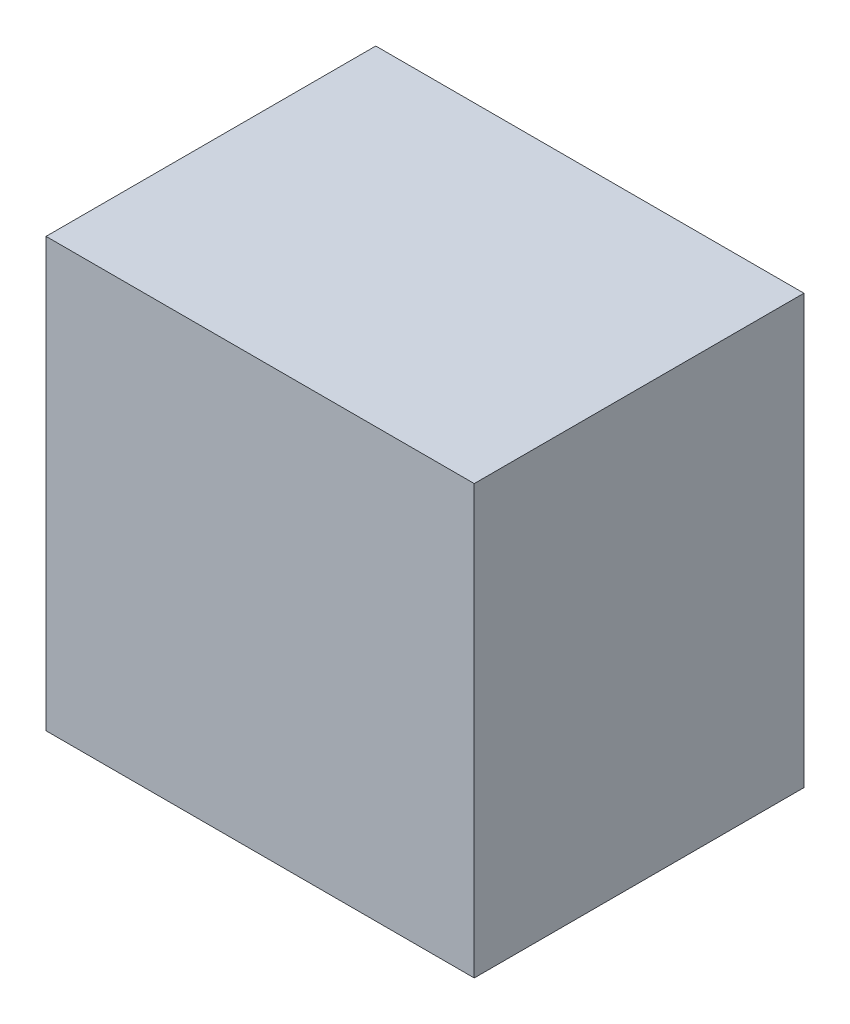
ISO-10303-21;
HEADER;
FILE_DESCRIPTION(('STEP AP214'),'2;1');
FILE_NAME('part.step','',(''),(''),'','','');
FILE_SCHEMA(('AUTOMOTIVE_DESIGN { 1 0 10303 214 1 1 1 1 }'));
ENDSEC;
DATA;
#1=APPLICATION_CONTEXT('core data for automotive mechanical design processes');
#2=APPLICATION_PROTOCOL_DEFINITION('international standard','automotive_design',2000,#1);
#3=PRODUCT_CONTEXT('',#1,'mechanical');
#4=PRODUCT('Part','Part','',(#3));
#5=PRODUCT_RELATED_PRODUCT_CATEGORY('part','',(#4));
#6=PRODUCT_DEFINITION_FORMATION('','',#4);
#7=PRODUCT_DEFINITION_CONTEXT('part definition',#1,'design');
#8=PRODUCT_DEFINITION('design','',#6,#7);
#9=PRODUCT_DEFINITION_SHAPE('','',#8);
#10=(LENGTH_UNIT() NAMED_UNIT(*) SI_UNIT(.MILLI.,.METRE.));
#11=(NAMED_UNIT(*) PLANE_ANGLE_UNIT() SI_UNIT($,.RADIAN.));
#12=(NAMED_UNIT(*) SI_UNIT($,.STERADIAN.) SOLID_ANGLE_UNIT());
#13=UNCERTAINTY_MEASURE_WITH_UNIT(LENGTH_MEASURE(1.E-05),#10,'distance_accuracy_value','');
#14=(GEOMETRIC_REPRESENTATION_CONTEXT(3) GLOBAL_UNCERTAINTY_ASSIGNED_CONTEXT((#13)) GLOBAL_UNIT_ASSIGNED_CONTEXT((#10,
#11,#12)) REPRESENTATION_CONTEXT('',''));
#15=CARTESIAN_POINT('',(0.,0.,0.));
#16=DIRECTION('',(0.,0.,1.));
#17=DIRECTION('',(1.,0.,0.));
#18=AXIS2_PLACEMENT_3D('',#15,#16,#17);
#19=CARTESIAN_POINT('',(-0.499999,0.499999,0.770001));
#20=DIRECTION('',(0.,0.,1.));
#21=DIRECTION('',(1.,0.,0.));
#22=AXIS2_PLACEMENT_3D('',#19,#20,#21);
#23=PLANE('',#22);
#24=DIRECTION('',(0.,1.,0.));
#25=VECTOR('',#24,1.);
#26=CARTESIAN_POINT('',(0.499999,0.499999,0.770001));
#27=LINE('',#26,#25);
#28=CARTESIAN_POINT('',(0.499999,0.499999,0.770001));
#29=VERTEX_POINT('',#28);
#30=CARTESIAN_POINT('',(0.499999,-0.499999,0.770001));
#31=VERTEX_POINT('',#30);
#32=EDGE_CURVE('E53',#29,#31,#27,.F.);
#33=ORIENTED_EDGE('',*,*,#32,.F.);
#34=DIRECTION('',(1.,0.,0.));
#35=VECTOR('',#34,1.);
#36=CARTESIAN_POINT('',(-0.499999,0.499999,0.770001));
#37=LINE('',#36,#35);
#38=CARTESIAN_POINT('',(-0.499999,0.499999,0.770001));
#39=VERTEX_POINT('',#38);
#40=EDGE_CURVE('E68',#39,#29,#37,.T.);
#41=ORIENTED_EDGE('',*,*,#40,.F.);
#42=DIRECTION('',(0.,1.,0.));
#43=VECTOR('',#42,1.);
#44=CARTESIAN_POINT('',(-0.499999,-0.499999,0.770001));
#45=LINE('',#44,#43);
#46=CARTESIAN_POINT('',(-0.499999,-0.499999,0.770001));
#47=VERTEX_POINT('',#46);
#48=EDGE_CURVE('E20',#47,#39,#45,.T.);
#49=ORIENTED_EDGE('',*,*,#48,.F.);
#50=DIRECTION('',(1.,0.,0.));
#51=VECTOR('',#50,1.);
#52=CARTESIAN_POINT('',(0.499999,-0.499999,0.770001));
#53=LINE('',#52,#51);
#54=EDGE_CURVE('E58',#31,#47,#53,.F.);
#55=ORIENTED_EDGE('',*,*,#54,.F.);
#56=EDGE_LOOP('',(#33,#41,#49,#55));
#57=FACE_BOUND('',#56,.T.);
#58=ADVANCED_FACE('F17',(#57),#23,.T.);
#59=CARTESIAN_POINT('',(-0.499999,-0.499999,0.));
#60=DIRECTION('',(-1.,0.,0.));
#61=DIRECTION('',(0.,0.,1.));
#62=AXIS2_PLACEMENT_3D('',#59,#60,#61);
#63=PLANE('',#62);
#64=DIRECTION('',(0.,0.,1.));
#65=VECTOR('',#64,1.);
#66=CARTESIAN_POINT('',(-0.499999,0.499999,0.));
#67=LINE('',#66,#65);
#68=CARTESIAN_POINT('',(-0.499999,0.499999,0.));
#69=VERTEX_POINT('',#68);
#70=EDGE_CURVE('E79',#69,#39,#67,.T.);
#71=ORIENTED_EDGE('',*,*,#70,.F.);
#72=DIRECTION('',(0.,1.,0.));
#73=VECTOR('',#72,1.);
#74=CARTESIAN_POINT('',(-0.499999,0.499999,0.));
#75=LINE('',#74,#73);
#76=CARTESIAN_POINT('',(-0.499999,-0.499999,0.));
#77=VERTEX_POINT('',#76);
#78=EDGE_CURVE('E74',#69,#77,#75,.F.);
#79=ORIENTED_EDGE('',*,*,#78,.T.);
#80=DIRECTION('',(0.,0.,-1.));
#81=VECTOR('',#80,1.);
#82=CARTESIAN_POINT('',(-0.499999,-0.499999,0.));
#83=LINE('',#82,#81);
#84=EDGE_CURVE('E63',#47,#77,#83,.T.);
#85=ORIENTED_EDGE('',*,*,#84,.F.);
#86=ORIENTED_EDGE('',*,*,#48,.T.);
#87=EDGE_LOOP('',(#71,#79,#85,#86));
#88=FACE_BOUND('',#87,.T.);
#89=ADVANCED_FACE('F73',(#88),#63,.T.);
#90=CARTESIAN_POINT('',(0.499999,-0.499999,0.));
#91=DIRECTION('',(0.,-1.,0.));
#92=DIRECTION('',(0.,0.,-1.));
#93=AXIS2_PLACEMENT_3D('',#90,#91,#92);
#94=PLANE('',#93);
#95=ORIENTED_EDGE('',*,*,#84,.T.);
#96=DIRECTION('',(1.,0.,0.));
#97=VECTOR('',#96,1.);
#98=CARTESIAN_POINT('',(-0.499999,-0.499999,0.));
#99=LINE('',#98,#97);
#100=CARTESIAN_POINT('',(0.499999,-0.499999,0.));
#101=VERTEX_POINT('',#100);
#102=EDGE_CURVE('E84',#77,#101,#99,.T.);
#103=ORIENTED_EDGE('',*,*,#102,.T.);
#104=DIRECTION('',(0.,0.,-1.));
#105=VECTOR('',#104,1.);
#106=CARTESIAN_POINT('',(0.499999,-0.499999,0.));
#107=LINE('',#106,#105);
#108=EDGE_CURVE('E65',#31,#101,#107,.T.);
#109=ORIENTED_EDGE('',*,*,#108,.F.);
#110=ORIENTED_EDGE('',*,*,#54,.T.);
#111=EDGE_LOOP('',(#95,#103,#109,#110));
#112=FACE_BOUND('',#111,.T.);
#113=ADVANCED_FACE('F60',(#112),#94,.T.);
#114=CARTESIAN_POINT('',(0.499999,0.499999,0.));
#115=DIRECTION('',(1.,0.,0.));
#116=DIRECTION('',(0.,0.,-1.));
#117=AXIS2_PLACEMENT_3D('',#114,#115,#116);
#118=PLANE('',#117);
#119=ORIENTED_EDGE('',*,*,#108,.T.);
#120=DIRECTION('',(0.,1.,0.));
#121=VECTOR('',#120,1.);
#122=CARTESIAN_POINT('',(0.499999,0.499999,0.));
#123=LINE('',#122,#121);
#124=CARTESIAN_POINT('',(0.499999,0.499999,0.));
#125=VERTEX_POINT('',#124);
#126=EDGE_CURVE('E26',#101,#125,#123,.T.);
#127=ORIENTED_EDGE('',*,*,#126,.T.);
#128=DIRECTION('',(0.,0.,1.));
#129=VECTOR('',#128,1.);
#130=CARTESIAN_POINT('',(0.499999,0.499999,0.));
#131=LINE('',#130,#129);
#132=EDGE_CURVE('E34',#29,#125,#131,.F.);
#133=ORIENTED_EDGE('',*,*,#132,.F.);
#134=ORIENTED_EDGE('',*,*,#32,.T.);
#135=EDGE_LOOP('',(#119,#127,#133,#134));
#136=FACE_BOUND('',#135,.T.);
#137=ADVANCED_FACE('F88',(#136),#118,.T.);
#138=CARTESIAN_POINT('',(-0.499999,0.499999,0.));
#139=DIRECTION('',(0.,1.,0.));
#140=DIRECTION('',(0.,0.,1.));
#141=AXIS2_PLACEMENT_3D('',#138,#139,#140);
#142=PLANE('',#141);
#143=ORIENTED_EDGE('',*,*,#132,.T.);
#144=DIRECTION('',(1.,0.,0.));
#145=VECTOR('',#144,1.);
#146=CARTESIAN_POINT('',(-0.499999,0.499999,0.));
#147=LINE('',#146,#145);
#148=EDGE_CURVE('E11',#125,#69,#147,.F.);
#149=ORIENTED_EDGE('',*,*,#148,.T.);
#150=ORIENTED_EDGE('',*,*,#70,.T.);
#151=ORIENTED_EDGE('',*,*,#40,.T.);
#152=EDGE_LOOP('',(#143,#149,#150,#151));
#153=FACE_BOUND('',#152,.T.);
#154=ADVANCED_FACE('F91',(#153),#142,.T.);
#155=CARTESIAN_POINT('',(-0.499999,0.499999,0.));
#156=DIRECTION('',(0.,0.,1.));
#157=DIRECTION('',(1.,0.,0.));
#158=AXIS2_PLACEMENT_3D('',#155,#156,#157);
#159=PLANE('',#158);
#160=ORIENTED_EDGE('',*,*,#126,.F.);
#161=ORIENTED_EDGE('',*,*,#102,.F.);
#162=ORIENTED_EDGE('',*,*,#78,.F.);
#163=ORIENTED_EDGE('',*,*,#148,.F.);
#164=EDGE_LOOP('',(#160,#161,#162,#163));
#165=FACE_BOUND('',#164,.T.);
#166=ADVANCED_FACE('F90',(#165),#159,.F.);
#167=CLOSED_SHELL('',(#58,#89,#113,#137,#154,#166));
#168=MANIFOLD_SOLID_BREP('B1',#167);
#169=ADVANCED_BREP_SHAPE_REPRESENTATION('',(#18,#168),#14);
#170=SHAPE_DEFINITION_REPRESENTATION(#9,#169);
ENDSEC;
END-ISO-10303-21;
